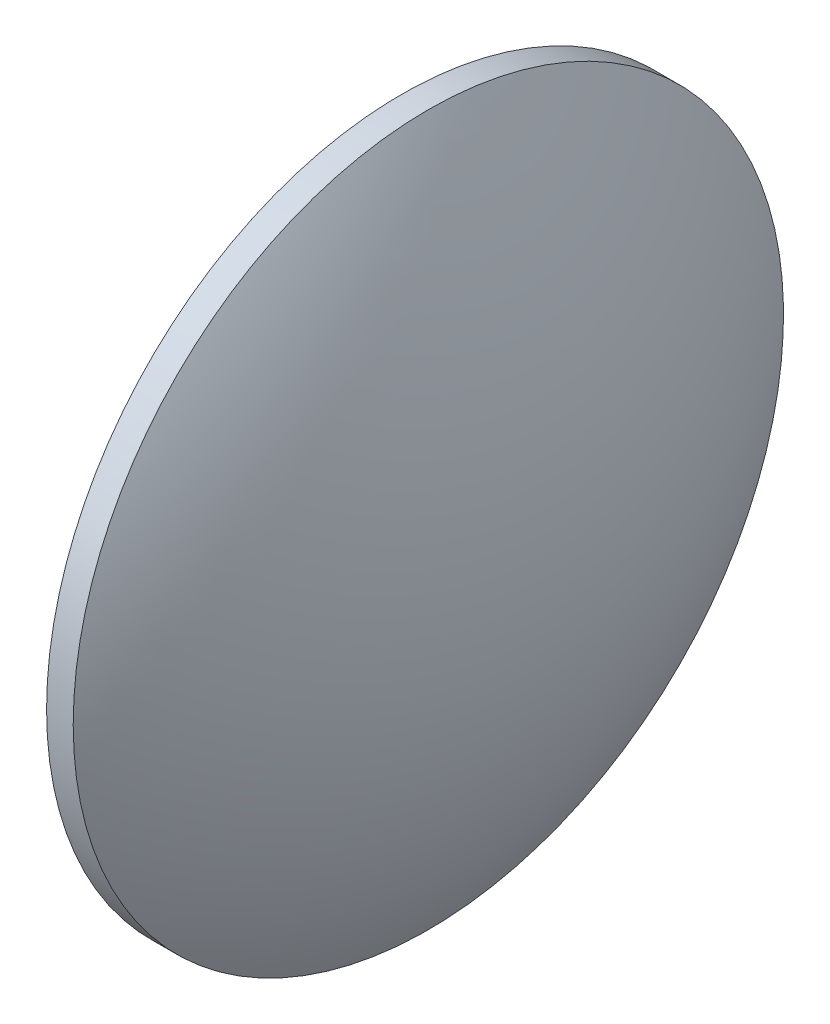
ISO-10303-21;
HEADER;
FILE_DESCRIPTION(('STEP AP214'),'2;1');
FILE_NAME('part.step','',(''),(''),'','','');
FILE_SCHEMA(('AUTOMOTIVE_DESIGN { 1 0 10303 214 1 1 1 1 }'));
ENDSEC;
DATA;
#1=APPLICATION_CONTEXT('core data for automotive mechanical design processes');
#2=APPLICATION_PROTOCOL_DEFINITION('international standard','automotive_design',2000,#1);
#3=PRODUCT_CONTEXT('',#1,'mechanical');
#4=PRODUCT('Part','Part','',(#3));
#5=PRODUCT_RELATED_PRODUCT_CATEGORY('part','',(#4));
#6=PRODUCT_DEFINITION_FORMATION('','',#4);
#7=PRODUCT_DEFINITION_CONTEXT('part definition',#1,'design');
#8=PRODUCT_DEFINITION('design','',#6,#7);
#9=PRODUCT_DEFINITION_SHAPE('','',#8);
#10=(LENGTH_UNIT() NAMED_UNIT(*) SI_UNIT(.MILLI.,.METRE.));
#11=(NAMED_UNIT(*) PLANE_ANGLE_UNIT() SI_UNIT($,.RADIAN.));
#12=(NAMED_UNIT(*) SI_UNIT($,.STERADIAN.) SOLID_ANGLE_UNIT());
#13=UNCERTAINTY_MEASURE_WITH_UNIT(LENGTH_MEASURE(1.E-05),#10,'distance_accuracy_value','');
#14=(GEOMETRIC_REPRESENTATION_CONTEXT(3) GLOBAL_UNCERTAINTY_ASSIGNED_CONTEXT((#13)) GLOBAL_UNIT_ASSIGNED_CONTEXT((#10,
#11,#12)) REPRESENTATION_CONTEXT('',''));
#15=CARTESIAN_POINT('',(0.,0.,0.));
#16=DIRECTION('',(0.,0.,1.));
#17=DIRECTION('',(1.,0.,0.));
#18=AXIS2_PLACEMENT_3D('',#15,#16,#17);
#19=CARTESIAN_POINT('',(172.773680295295,130.041890759925,0.));
#20=DIRECTION('',(-1.,0.,0.));
#21=DIRECTION('',(0.,1.,0.));
#22=AXIS2_PLACEMENT_3D('',#19,#20,#21);
#23=SPHERICAL_SURFACE('',#22,77.5024460431654);
#24=CARTESIAN_POINT('',(239.15612633846,130.041890759925,0.));
#25=DIRECTION('',(-1.,0.,0.));
#26=DIRECTION('',(0.,0.,1.));
#27=AXIS2_PLACEMENT_3D('',#24,#25,#26);
#28=CIRCLE('',#27,40.);
#29=CARTESIAN_POINT('',(239.15612633846,130.041890759925,40.));
#30=VERTEX_POINT('',#29);
#31=EDGE_CURVE('E10',#30,#30,#28,.T.);
#32=ORIENTED_EDGE('',*,*,#31,.F.);
#33=EDGE_LOOP('',(#32));
#34=FACE_BOUND('',#33,.T.);
#35=ADVANCED_FACE('F33',(#34),#23,.T.);
#36=CARTESIAN_POINT('',(217.331148660887,130.041890759925,0.));
#37=DIRECTION('',(-1.,0.,0.));
#38=DIRECTION('',(0.,0.,1.));
#39=AXIS2_PLACEMENT_3D('',#36,#37,#38);
#40=CYLINDRICAL_SURFACE('',#39,40.);
#41=CARTESIAN_POINT('',(236.15612633846,130.041890759925,0.));
#42=DIRECTION('',(-1.,0.,0.));
#43=DIRECTION('',(0.,0.,1.));
#44=AXIS2_PLACEMENT_3D('',#41,#42,#43);
#45=CIRCLE('',#44,40.);
#46=CARTESIAN_POINT('',(236.15612633846,130.041890759925,40.));
#47=VERTEX_POINT('',#46);
#48=EDGE_CURVE('E39',#47,#47,#45,.T.);
#49=ORIENTED_EDGE('',*,*,#48,.F.);
#50=EDGE_LOOP('',(#49));
#51=FACE_BOUND('',#50,.T.);
#52=ORIENTED_EDGE('',*,*,#31,.T.);
#53=EDGE_LOOP('',(#52));
#54=FACE_BOUND('',#53,.T.);
#55=ADVANCED_FACE('F47',(#51,#54),#40,.T.);
#56=CARTESIAN_POINT('',(236.15612633846,130.041890759925,0.));
#57=DIRECTION('',(1.,0.,0.));
#58=DIRECTION('',(0.,0.,-1.));
#59=AXIS2_PLACEMENT_3D('',#56,#57,#58);
#60=PLANE('',#59);
#61=ORIENTED_EDGE('',*,*,#48,.T.);
#62=EDGE_LOOP('',(#61));
#63=FACE_BOUND('',#62,.T.);
#64=ADVANCED_FACE('F45',(#63),#60,.F.);
#65=CLOSED_SHELL('',(#35,#55,#64));
#66=MANIFOLD_SOLID_BREP('B2',#65);
#67=ADVANCED_BREP_SHAPE_REPRESENTATION('',(#18,#66),#14);
#68=SHAPE_DEFINITION_REPRESENTATION(#9,#67);
ENDSEC;
END-ISO-10303-21;
